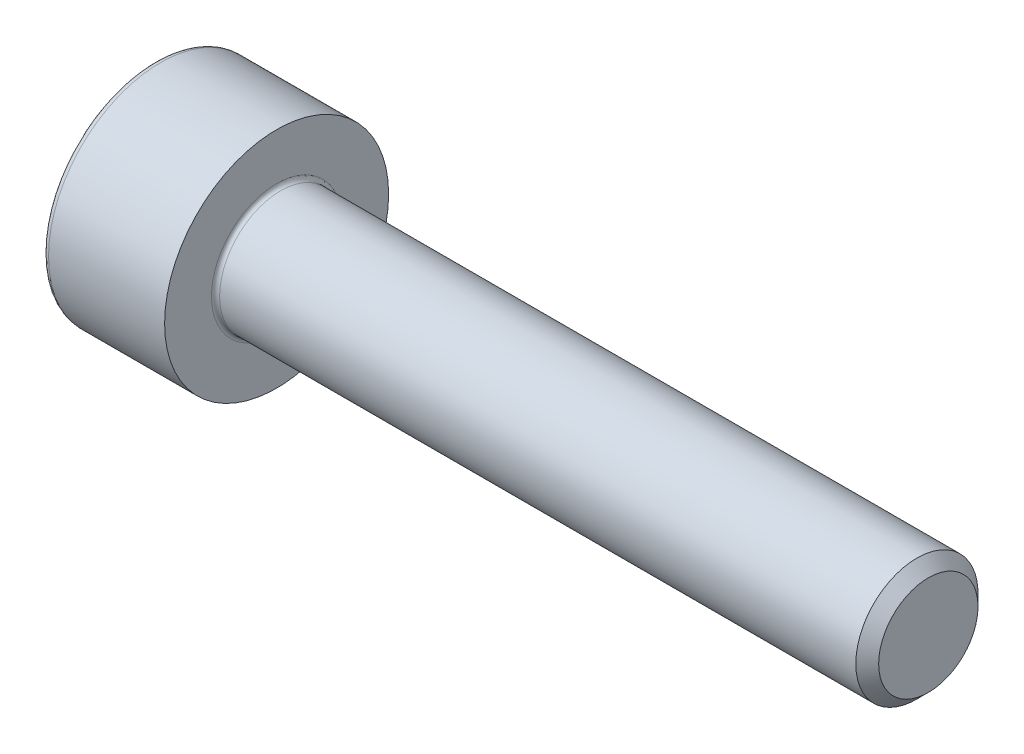
ISO-10303-21;
HEADER;
FILE_DESCRIPTION(('STEP AP214'),'2;1');
FILE_NAME('part.step','',(''),(''),'','','');
FILE_SCHEMA(('AUTOMOTIVE_DESIGN { 1 0 10303 214 1 1 1 1 }'));
ENDSEC;
DATA;
#1=APPLICATION_CONTEXT('core data for automotive mechanical design processes');
#2=APPLICATION_PROTOCOL_DEFINITION('international standard','automotive_design',2000,#1);
#3=PRODUCT_CONTEXT('',#1,'mechanical');
#4=PRODUCT('Part','Part','',(#3));
#5=PRODUCT_RELATED_PRODUCT_CATEGORY('part','',(#4));
#6=PRODUCT_DEFINITION_FORMATION('','',#4);
#7=PRODUCT_DEFINITION_CONTEXT('part definition',#1,'design');
#8=PRODUCT_DEFINITION('design','',#6,#7);
#9=PRODUCT_DEFINITION_SHAPE('','',#8);
#10=(LENGTH_UNIT() NAMED_UNIT(*) SI_UNIT(.MILLI.,.METRE.));
#11=(NAMED_UNIT(*) PLANE_ANGLE_UNIT() SI_UNIT($,.RADIAN.));
#12=(NAMED_UNIT(*) SI_UNIT($,.STERADIAN.) SOLID_ANGLE_UNIT());
#13=UNCERTAINTY_MEASURE_WITH_UNIT(LENGTH_MEASURE(1.E-05),#10,'distance_accuracy_value','');
#14=(GEOMETRIC_REPRESENTATION_CONTEXT(3) GLOBAL_UNCERTAINTY_ASSIGNED_CONTEXT((#13)) GLOBAL_UNIT_ASSIGNED_CONTEXT((#10,
#11,#12)) REPRESENTATION_CONTEXT('',''));
#15=CARTESIAN_POINT('',(0.,0.,0.));
#16=DIRECTION('',(0.,0.,1.));
#17=DIRECTION('',(1.,0.,0.));
#18=AXIS2_PLACEMENT_3D('',#15,#16,#17);
#19=CARTESIAN_POINT('',(0.,0.,0.));
#20=DIRECTION('',(-1.,0.,0.));
#21=DIRECTION('',(0.,0.,1.));
#22=AXIS2_PLACEMENT_3D('',#19,#20,#21);
#23=PLANE('',#22);
#24=DIRECTION('',(0.,-0.499999999999999,0.866025403784439));
#25=VECTOR('',#24,1.);
#26=CARTESIAN_POINT('',(0.,1.47801668912544,0.));
#27=LINE('',#26,#25);
#28=CARTESIAN_POINT('',(0.,1.47801668912544,0.));
#29=VERTEX_POINT('',#28);
#30=CARTESIAN_POINT('',(0.,0.73900834456272,1.28));
#31=VERTEX_POINT('',#30);
#32=EDGE_CURVE('E256',#29,#31,#27,.T.);
#33=ORIENTED_EDGE('',*,*,#32,.T.);
#34=DIRECTION('',(0.,1.,0.));
#35=VECTOR('',#34,1.);
#36=CARTESIAN_POINT('',(0.,-0.739008344562723,1.28));
#37=LINE('',#36,#35);
#38=CARTESIAN_POINT('',(0.,-0.739008344562723,1.28));
#39=VERTEX_POINT('',#38);
#40=EDGE_CURVE('E128',#39,#31,#37,.T.);
#41=ORIENTED_EDGE('',*,*,#40,.F.);
#42=DIRECTION('',(0.,-0.500000000000001,-0.866025403784438));
#43=VECTOR('',#42,1.);
#44=CARTESIAN_POINT('',(0.,-0.739008344562723,1.28));
#45=LINE('',#44,#43);
#46=CARTESIAN_POINT('',(0.,-1.47801668912545,0.));
#47=VERTEX_POINT('',#46);
#48=EDGE_CURVE('E259',#39,#47,#45,.T.);
#49=ORIENTED_EDGE('',*,*,#48,.T.);
#50=DIRECTION('',(0.,0.499999999999999,-0.866025403784439));
#51=VECTOR('',#50,1.);
#52=CARTESIAN_POINT('',(0.,-1.47801668912545,0.));
#53=LINE('',#52,#51);
#54=CARTESIAN_POINT('',(0.,-0.739008344562726,-1.28));
#55=VERTEX_POINT('',#54);
#56=EDGE_CURVE('E262',#47,#55,#53,.T.);
#57=ORIENTED_EDGE('',*,*,#56,.T.);
#58=DIRECTION('',(0.,-1.,0.));
#59=VECTOR('',#58,1.);
#60=CARTESIAN_POINT('',(0.,0.739008344562715,-1.28));
#61=LINE('',#60,#59);
#62=CARTESIAN_POINT('',(0.,0.739008344562715,-1.28));
#63=VERTEX_POINT('',#62);
#64=EDGE_CURVE('E265',#63,#55,#61,.T.);
#65=ORIENTED_EDGE('',*,*,#64,.F.);
#66=DIRECTION('',(0.,-0.500000000000002,-0.866025403784437));
#67=VECTOR('',#66,1.);
#68=CARTESIAN_POINT('',(0.,1.47801668912544,0.));
#69=LINE('',#68,#67);
#70=EDGE_CURVE('E123',#29,#63,#69,.T.);
#71=ORIENTED_EDGE('',*,*,#70,.F.);
#72=EDGE_LOOP('',(#33,#41,#49,#57,#65,#71));
#73=FACE_BOUND('',#72,.T.);
#74=CARTESIAN_POINT('',(0.,0.,0.));
#75=DIRECTION('',(-1.,0.,0.));
#76=DIRECTION('',(0.,0.,1.));
#77=AXIS2_PLACEMENT_3D('',#74,#75,#76);
#78=CIRCLE('',#77,2.6);
#79=CARTESIAN_POINT('',(0.,0.,2.6));
#80=VERTEX_POINT('',#79);
#81=EDGE_CURVE('E40',#80,#80,#78,.T.);
#82=ORIENTED_EDGE('',*,*,#81,.T.);
#83=EDGE_LOOP('',(#82));
#84=FACE_BOUND('',#83,.T.);
#85=ADVANCED_FACE('F32',(#73,#84),#23,.T.);
#86=CARTESIAN_POINT('',(-31.75,0.,0.));
#87=DIRECTION('',(-1.,0.,0.));
#88=DIRECTION('',(0.,0.,1.));
#89=AXIS2_PLACEMENT_3D('',#86,#87,#88);
#90=CYLINDRICAL_SURFACE('',#89,2.75);
#91=CARTESIAN_POINT('',(0.149999999999997,0.,0.));
#92=DIRECTION('',(-1.,0.,0.));
#93=DIRECTION('',(0.,0.,1.));
#94=AXIS2_PLACEMENT_3D('',#91,#92,#93);
#95=CIRCLE('',#94,2.75);
#96=CARTESIAN_POINT('',(0.149999999999997,0.,2.75));
#97=VERTEX_POINT('',#96);
#98=EDGE_CURVE('E11',#97,#97,#95,.F.);
#99=ORIENTED_EDGE('',*,*,#98,.T.);
#100=EDGE_LOOP('',(#99));
#101=FACE_BOUND('',#100,.T.);
#102=CARTESIAN_POINT('',(3.,0.,0.));
#103=DIRECTION('',(-1.,0.,0.));
#104=DIRECTION('',(0.,0.,1.));
#105=AXIS2_PLACEMENT_3D('',#102,#103,#104);
#106=CIRCLE('',#105,2.75);
#107=CARTESIAN_POINT('',(3.,0.,2.75));
#108=VERTEX_POINT('',#107);
#109=EDGE_CURVE('E146',#108,#108,#106,.T.);
#110=ORIENTED_EDGE('',*,*,#109,.T.);
#111=EDGE_LOOP('',(#110));
#112=FACE_BOUND('',#111,.T.);
#113=ADVANCED_FACE('F170',(#101,#112),#90,.T.);
#114=CARTESIAN_POINT('',(3.,2.75,0.));
#115=DIRECTION('',(1.,0.,0.));
#116=DIRECTION('',(0.,0.,-1.));
#117=AXIS2_PLACEMENT_3D('',#114,#115,#116);
#118=PLANE('',#117);
#119=CARTESIAN_POINT('',(3.,0.,0.));
#120=DIRECTION('',(1.,0.,0.));
#121=DIRECTION('',(0.,0.,-1.));
#122=AXIS2_PLACEMENT_3D('',#119,#120,#121);
#123=CIRCLE('',#122,1.6);
#124=CARTESIAN_POINT('',(3.,0.,-1.6));
#125=VERTEX_POINT('',#124);
#126=EDGE_CURVE('E149',#125,#125,#123,.F.);
#127=ORIENTED_EDGE('',*,*,#126,.T.);
#128=EDGE_LOOP('',(#127));
#129=FACE_BOUND('',#128,.T.);
#130=ORIENTED_EDGE('',*,*,#109,.F.);
#131=EDGE_LOOP('',(#130));
#132=FACE_BOUND('',#131,.T.);
#133=ADVANCED_FACE('F176',(#129,#132),#118,.T.);
#134=CARTESIAN_POINT('',(-31.75,0.,0.));
#135=DIRECTION('',(-1.,0.,0.));
#136=DIRECTION('',(0.,0.,1.));
#137=AXIS2_PLACEMENT_3D('',#134,#135,#136);
#138=CYLINDRICAL_SURFACE('',#137,1.5);
#139=CARTESIAN_POINT('',(3.1,0.,0.));
#140=DIRECTION('',(1.,0.,0.));
#141=DIRECTION('',(0.,0.,-1.));
#142=AXIS2_PLACEMENT_3D('',#139,#140,#141);
#143=CIRCLE('',#142,1.5);
#144=CARTESIAN_POINT('',(3.1,0.,-1.5));
#145=VERTEX_POINT('',#144);
#146=EDGE_CURVE('E152',#145,#145,#143,.T.);
#147=ORIENTED_EDGE('',*,*,#146,.T.);
#148=EDGE_LOOP('',(#147));
#149=FACE_BOUND('',#148,.T.);
#150=CARTESIAN_POINT('',(18.7195,0.,0.));
#151=DIRECTION('',(-1.,0.,0.));
#152=DIRECTION('',(0.,0.,1.));
#153=AXIS2_PLACEMENT_3D('',#150,#151,#152);
#154=CIRCLE('',#153,1.5);
#155=CARTESIAN_POINT('',(18.7195,0.,1.5));
#156=VERTEX_POINT('',#155);
#157=EDGE_CURVE('E143',#156,#156,#154,.T.);
#158=ORIENTED_EDGE('',*,*,#157,.T.);
#159=EDGE_LOOP('',(#158));
#160=FACE_BOUND('',#159,.T.);
#161=ADVANCED_FACE('F182',(#149,#160),#138,.T.);
#162=CARTESIAN_POINT('',(19.,0.,0.));
#163=DIRECTION('',(-1.,0.,0.));
#164=DIRECTION('',(0.,0.,1.));
#165=AXIS2_PLACEMENT_3D('',#162,#163,#164);
#166=CONICAL_SURFACE('',#165,1.2195,0.785398163397467);
#167=ORIENTED_EDGE('',*,*,#157,.F.);
#168=EDGE_LOOP('',(#167));
#169=FACE_BOUND('',#168,.T.);
#170=CARTESIAN_POINT('',(19.,0.,0.));
#171=DIRECTION('',(-1.,0.,0.));
#172=DIRECTION('',(0.,0.,1.));
#173=AXIS2_PLACEMENT_3D('',#170,#171,#172);
#174=CIRCLE('',#173,1.2195);
#175=CARTESIAN_POINT('',(19.,0.,1.2195));
#176=VERTEX_POINT('',#175);
#177=EDGE_CURVE('E139',#176,#176,#174,.T.);
#178=ORIENTED_EDGE('',*,*,#177,.T.);
#179=EDGE_LOOP('',(#178));
#180=FACE_BOUND('',#179,.T.);
#181=ADVANCED_FACE('F186',(#169,#180),#166,.T.);
#182=CARTESIAN_POINT('',(19.,1.2195,0.));
#183=DIRECTION('',(1.,0.,0.));
#184=DIRECTION('',(0.,0.,-1.));
#185=AXIS2_PLACEMENT_3D('',#182,#183,#184);
#186=PLANE('',#185);
#187=ORIENTED_EDGE('',*,*,#177,.F.);
#188=EDGE_LOOP('',(#187));
#189=FACE_BOUND('',#188,.T.);
#190=ADVANCED_FACE('F166',(#189),#186,.T.);
#191=CARTESIAN_POINT('',(3.1,0.,0.));
#192=DIRECTION('',(1.,0.,0.));
#193=DIRECTION('',(0.,0.,-1.));
#194=AXIS2_PLACEMENT_3D('',#191,#192,#193);
#195=TOROIDAL_SURFACE('',#194,1.6,0.1);
#196=ORIENTED_EDGE('',*,*,#146,.F.);
#197=EDGE_LOOP('',(#196));
#198=FACE_BOUND('',#197,.T.);
#199=ORIENTED_EDGE('',*,*,#126,.F.);
#200=EDGE_LOOP('',(#199));
#201=FACE_BOUND('',#200,.T.);
#202=ADVANCED_FACE('F159',(#198,#201),#195,.F.);
#203=CARTESIAN_POINT('',(0.149999999999997,0.,0.));
#204=DIRECTION('',(-1.,0.,0.));
#205=DIRECTION('',(0.,0.,1.));
#206=AXIS2_PLACEMENT_3D('',#203,#204,#205);
#207=TOROIDAL_SURFACE('',#206,2.6,0.15);
#208=ORIENTED_EDGE('',*,*,#98,.F.);
#209=EDGE_LOOP('',(#208));
#210=FACE_BOUND('',#209,.T.);
#211=ORIENTED_EDGE('',*,*,#81,.F.);
#212=EDGE_LOOP('',(#211));
#213=FACE_BOUND('',#212,.T.);
#214=ADVANCED_FACE('F34',(#210,#213),#207,.T.);
#215=CARTESIAN_POINT('',(1.3,1.47801668912544,0.));
#216=DIRECTION('',(0.,-0.866025403784439,-0.499999999999999));
#217=DIRECTION('',(0.,0.499999999999999,-0.866025403784439));
#218=AXIS2_PLACEMENT_3D('',#215,#216,#217);
#219=PLANE('',#218);
#220=ORIENTED_EDGE('',*,*,#32,.F.);
#221=DIRECTION('',(-1.,0.,0.));
#222=VECTOR('',#221,1.);
#223=CARTESIAN_POINT('',(1.3,1.47801668912544,0.));
#224=LINE('',#223,#222);
#225=CARTESIAN_POINT('',(1.3,1.47801668912544,0.));
#226=VERTEX_POINT('',#225);
#227=EDGE_CURVE('E246',#226,#29,#224,.T.);
#228=ORIENTED_EDGE('',*,*,#227,.F.);
#229=DIRECTION('',(0.,-0.499999999999999,0.866025403784439));
#230=VECTOR('',#229,1.);
#231=CARTESIAN_POINT('',(1.3,1.47801668912544,0.));
#232=LINE('',#231,#230);
#233=CARTESIAN_POINT('',(1.3,1.10851251684408,0.639999999999997));
#234=VERTEX_POINT('',#233);
#235=EDGE_CURVE('E115',#226,#234,#232,.T.);
#236=ORIENTED_EDGE('',*,*,#235,.T.);
#237=CARTESIAN_POINT('',(1.3,0.73900834456272,1.28));
#238=VERTEX_POINT('',#237);
#239=EDGE_CURVE('E106',#234,#238,#232,.T.);
#240=ORIENTED_EDGE('',*,*,#239,.T.);
#241=DIRECTION('',(-1.,0.,0.));
#242=VECTOR('',#241,1.);
#243=CARTESIAN_POINT('',(1.3,0.73900834456272,1.28));
#244=LINE('',#243,#242);
#245=EDGE_CURVE('E120',#238,#31,#244,.T.);
#246=ORIENTED_EDGE('',*,*,#245,.T.);
#247=EDGE_LOOP('',(#220,#228,#236,#240,#246));
#248=FACE_BOUND('',#247,.T.);
#249=ADVANCED_FACE('F119',(#248),#219,.T.);
#250=CARTESIAN_POINT('',(1.3,-0.739008344562723,1.28));
#251=DIRECTION('',(0.,0.,1.));
#252=DIRECTION('',(0.,-1.,0.));
#253=AXIS2_PLACEMENT_3D('',#250,#251,#252);
#254=PLANE('',#253);
#255=ORIENTED_EDGE('',*,*,#40,.T.);
#256=ORIENTED_EDGE('',*,*,#245,.F.);
#257=DIRECTION('',(0.,1.,0.));
#258=VECTOR('',#257,1.);
#259=CARTESIAN_POINT('',(1.3,-0.739008344562723,1.28));
#260=LINE('',#259,#258);
#261=CARTESIAN_POINT('',(1.3,0.,1.28));
#262=VERTEX_POINT('',#261);
#263=EDGE_CURVE('E103',#262,#238,#260,.T.);
#264=ORIENTED_EDGE('',*,*,#263,.F.);
#265=CARTESIAN_POINT('',(1.3,-0.739008344562723,1.28));
#266=VERTEX_POINT('',#265);
#267=EDGE_CURVE('E114',#266,#262,#260,.T.);
#268=ORIENTED_EDGE('',*,*,#267,.F.);
#269=DIRECTION('',(-1.,0.,0.));
#270=VECTOR('',#269,1.);
#271=CARTESIAN_POINT('',(1.3,-0.739008344562723,1.28));
#272=LINE('',#271,#270);
#273=EDGE_CURVE('E130',#266,#39,#272,.T.);
#274=ORIENTED_EDGE('',*,*,#273,.T.);
#275=EDGE_LOOP('',(#255,#256,#264,#268,#274));
#276=FACE_BOUND('',#275,.T.);
#277=ADVANCED_FACE('F125',(#276),#254,.F.);
#278=CARTESIAN_POINT('',(1.3,-0.739008344562723,1.28));
#279=DIRECTION('',(0.,0.866025403784438,-0.500000000000001));
#280=DIRECTION('',(0.,0.500000000000001,0.866025403784438));
#281=AXIS2_PLACEMENT_3D('',#278,#279,#280);
#282=PLANE('',#281);
#283=ORIENTED_EDGE('',*,*,#48,.F.);
#284=ORIENTED_EDGE('',*,*,#273,.F.);
#285=DIRECTION('',(0.,-0.500000000000001,-0.866025403784438));
#286=VECTOR('',#285,1.);
#287=CARTESIAN_POINT('',(1.3,-0.739008344562723,1.28));
#288=LINE('',#287,#286);
#289=CARTESIAN_POINT('',(1.3,-1.10851251684408,0.640000000000002));
#290=VERTEX_POINT('',#289);
#291=EDGE_CURVE('E285',#266,#290,#288,.T.);
#292=ORIENTED_EDGE('',*,*,#291,.T.);
#293=CARTESIAN_POINT('',(1.3,-1.47801668912545,0.));
#294=VERTEX_POINT('',#293);
#295=EDGE_CURVE('E274',#290,#294,#288,.T.);
#296=ORIENTED_EDGE('',*,*,#295,.T.);
#297=DIRECTION('',(-1.,0.,0.));
#298=VECTOR('',#297,1.);
#299=CARTESIAN_POINT('',(1.3,-1.47801668912545,0.));
#300=LINE('',#299,#298);
#301=EDGE_CURVE('E135',#294,#47,#300,.T.);
#302=ORIENTED_EDGE('',*,*,#301,.T.);
#303=EDGE_LOOP('',(#283,#284,#292,#296,#302));
#304=FACE_BOUND('',#303,.T.);
#305=ADVANCED_FACE('F200',(#304),#282,.T.);
#306=CARTESIAN_POINT('',(1.3,-1.47801668912545,0.));
#307=DIRECTION('',(0.,0.866025403784439,0.499999999999999));
#308=DIRECTION('',(0.,-0.499999999999999,0.866025403784439));
#309=AXIS2_PLACEMENT_3D('',#306,#307,#308);
#310=PLANE('',#309);
#311=ORIENTED_EDGE('',*,*,#56,.F.);
#312=ORIENTED_EDGE('',*,*,#301,.F.);
#313=DIRECTION('',(0.,0.499999999999999,-0.866025403784439));
#314=VECTOR('',#313,1.);
#315=CARTESIAN_POINT('',(1.3,-1.47801668912545,0.));
#316=LINE('',#315,#314);
#317=CARTESIAN_POINT('',(1.3,-1.10851251684409,-0.640000000000002));
#318=VERTEX_POINT('',#317);
#319=EDGE_CURVE('E252',#294,#318,#316,.T.);
#320=ORIENTED_EDGE('',*,*,#319,.T.);
#321=CARTESIAN_POINT('',(1.3,-0.739008344562726,-1.28));
#322=VERTEX_POINT('',#321);
#323=EDGE_CURVE('E284',#318,#322,#316,.T.);
#324=ORIENTED_EDGE('',*,*,#323,.T.);
#325=DIRECTION('',(-1.,0.,0.));
#326=VECTOR('',#325,1.);
#327=CARTESIAN_POINT('',(1.3,-0.739008344562726,-1.28));
#328=LINE('',#327,#326);
#329=EDGE_CURVE('E245',#322,#55,#328,.T.);
#330=ORIENTED_EDGE('',*,*,#329,.T.);
#331=EDGE_LOOP('',(#311,#312,#320,#324,#330));
#332=FACE_BOUND('',#331,.T.);
#333=ADVANCED_FACE('F203',(#332),#310,.T.);
#334=CARTESIAN_POINT('',(1.3,0.739008344562715,-1.28));
#335=DIRECTION('',(0.,0.,-1.));
#336=DIRECTION('',(0.,1.,0.));
#337=AXIS2_PLACEMENT_3D('',#334,#335,#336);
#338=PLANE('',#337);
#339=ORIENTED_EDGE('',*,*,#64,.T.);
#340=ORIENTED_EDGE('',*,*,#329,.F.);
#341=DIRECTION('',(0.,-1.,0.));
#342=VECTOR('',#341,1.);
#343=CARTESIAN_POINT('',(1.3,0.739008344562715,-1.28));
#344=LINE('',#343,#342);
#345=CARTESIAN_POINT('',(1.3,0.,-1.28));
#346=VERTEX_POINT('',#345);
#347=EDGE_CURVE('E249',#346,#322,#344,.T.);
#348=ORIENTED_EDGE('',*,*,#347,.F.);
#349=CARTESIAN_POINT('',(1.3,0.739008344562715,-1.28));
#350=VERTEX_POINT('',#349);
#351=EDGE_CURVE('E47',#350,#346,#344,.T.);
#352=ORIENTED_EDGE('',*,*,#351,.F.);
#353=DIRECTION('',(-1.,0.,0.));
#354=VECTOR('',#353,1.);
#355=CARTESIAN_POINT('',(1.3,0.739008344562715,-1.28));
#356=LINE('',#355,#354);
#357=EDGE_CURVE('E242',#350,#63,#356,.T.);
#358=ORIENTED_EDGE('',*,*,#357,.T.);
#359=EDGE_LOOP('',(#339,#340,#348,#352,#358));
#360=FACE_BOUND('',#359,.T.);
#361=ADVANCED_FACE('F207',(#360),#338,.F.);
#362=CARTESIAN_POINT('',(1.3,1.47801668912544,0.));
#363=DIRECTION('',(0.,0.866025403784437,-0.500000000000002));
#364=DIRECTION('',(0.,0.500000000000002,0.866025403784437));
#365=AXIS2_PLACEMENT_3D('',#362,#363,#364);
#366=PLANE('',#365);
#367=ORIENTED_EDGE('',*,*,#70,.T.);
#368=ORIENTED_EDGE('',*,*,#357,.F.);
#369=DIRECTION('',(0.,-0.500000000000002,-0.866025403784437));
#370=VECTOR('',#369,1.);
#371=CARTESIAN_POINT('',(1.3,1.47801668912544,0.));
#372=LINE('',#371,#370);
#373=CARTESIAN_POINT('',(1.3,1.10851251684408,-0.640000000000002));
#374=VERTEX_POINT('',#373);
#375=EDGE_CURVE('E232',#374,#350,#372,.T.);
#376=ORIENTED_EDGE('',*,*,#375,.F.);
#377=EDGE_CURVE('E238',#226,#374,#372,.T.);
#378=ORIENTED_EDGE('',*,*,#377,.F.);
#379=ORIENTED_EDGE('',*,*,#227,.T.);
#380=EDGE_LOOP('',(#367,#368,#376,#378,#379));
#381=FACE_BOUND('',#380,.T.);
#382=ADVANCED_FACE('F211',(#381),#366,.F.);
#383=CARTESIAN_POINT('',(1.3,1.47801668912544,0.));
#384=DIRECTION('',(1.,0.,0.));
#385=DIRECTION('',(0.,0.,-1.));
#386=AXIS2_PLACEMENT_3D('',#383,#384,#385);
#387=PLANE('',#386);
#388=ORIENTED_EDGE('',*,*,#347,.T.);
#389=ORIENTED_EDGE('',*,*,#323,.F.);
#390=CARTESIAN_POINT('',(1.3,0.,0.));
#391=DIRECTION('',(-1.,0.,0.));
#392=DIRECTION('',(0.,0.,1.));
#393=AXIS2_PLACEMENT_3D('',#390,#391,#392);
#394=CIRCLE('',#393,1.28);
#395=EDGE_CURVE('E280',#346,#318,#394,.T.);
#396=ORIENTED_EDGE('',*,*,#395,.F.);
#397=EDGE_LOOP('',(#388,#389,#396));
#398=FACE_BOUND('',#397,.T.);
#399=ADVANCED_FACE('F215',(#398),#387,.F.);
#400=ORIENTED_EDGE('',*,*,#319,.F.);
#401=ORIENTED_EDGE('',*,*,#295,.F.);
#402=EDGE_CURVE('E133',#318,#290,#394,.T.);
#403=ORIENTED_EDGE('',*,*,#402,.F.);
#404=EDGE_LOOP('',(#400,#401,#403));
#405=FACE_BOUND('',#404,.T.);
#406=ADVANCED_FACE('F218',(#405),#387,.F.);
#407=ORIENTED_EDGE('',*,*,#291,.F.);
#408=ORIENTED_EDGE('',*,*,#267,.T.);
#409=EDGE_CURVE('E129',#290,#262,#394,.T.);
#410=ORIENTED_EDGE('',*,*,#409,.F.);
#411=EDGE_LOOP('',(#407,#408,#410));
#412=FACE_BOUND('',#411,.T.);
#413=ADVANCED_FACE('F223',(#412),#387,.F.);
#414=ORIENTED_EDGE('',*,*,#263,.T.);
#415=ORIENTED_EDGE('',*,*,#239,.F.);
#416=EDGE_CURVE('E109',#262,#234,#394,.T.);
#417=ORIENTED_EDGE('',*,*,#416,.F.);
#418=EDGE_LOOP('',(#414,#415,#417));
#419=FACE_BOUND('',#418,.T.);
#420=ADVANCED_FACE('F105',(#419),#387,.F.);
#421=ORIENTED_EDGE('',*,*,#235,.F.);
#422=ORIENTED_EDGE('',*,*,#377,.T.);
#423=EDGE_CURVE('E140',#234,#374,#394,.T.);
#424=ORIENTED_EDGE('',*,*,#423,.F.);
#425=EDGE_LOOP('',(#421,#422,#424));
#426=FACE_BOUND('',#425,.T.);
#427=ADVANCED_FACE('F226',(#426),#387,.F.);
#428=ORIENTED_EDGE('',*,*,#375,.T.);
#429=ORIENTED_EDGE('',*,*,#351,.T.);
#430=EDGE_CURVE('E235',#374,#346,#394,.T.);
#431=ORIENTED_EDGE('',*,*,#430,.F.);
#432=EDGE_LOOP('',(#428,#429,#431));
#433=FACE_BOUND('',#432,.T.);
#434=ADVANCED_FACE('F196',(#433),#387,.F.);
#435=CARTESIAN_POINT('',(1.3,0.,0.));
#436=DIRECTION('',(-1.,0.,0.));
#437=DIRECTION('',(0.,0.,1.));
#438=AXIS2_PLACEMENT_3D('',#435,#436,#437);
#439=CONICAL_SURFACE('',#438,1.28,1.04719755119659);
#440=CARTESIAN_POINT('',(2.03900834456273,0.,0.));
#441=VERTEX_POINT('',#440);
#442=VERTEX_LOOP('',#441);
#443=FACE_BOUND('',#442,.T.);
#444=ORIENTED_EDGE('',*,*,#416,.T.);
#445=ORIENTED_EDGE('',*,*,#423,.T.);
#446=ORIENTED_EDGE('',*,*,#430,.T.);
#447=ORIENTED_EDGE('',*,*,#395,.T.);
#448=ORIENTED_EDGE('',*,*,#402,.T.);
#449=ORIENTED_EDGE('',*,*,#409,.T.);
#450=EDGE_LOOP('',(#444,#445,#446,#447,#448,#449));
#451=FACE_BOUND('',#450,.T.);
#452=ADVANCED_FACE('F194',(#443,#451),#439,.F.);
#453=CLOSED_SHELL('',(#85,#113,#133,#161,#181,#190,#202,#214,#249,#277,#305,#333,#361,#382,#399,
#406,#413,#420,#427,#434,#452));
#454=MANIFOLD_SOLID_BREP('B2',#453);
#455=ADVANCED_BREP_SHAPE_REPRESENTATION('',(#18,#454),#14);
#456=SHAPE_DEFINITION_REPRESENTATION(#9,#455);
ENDSEC;
END-ISO-10303-21;
